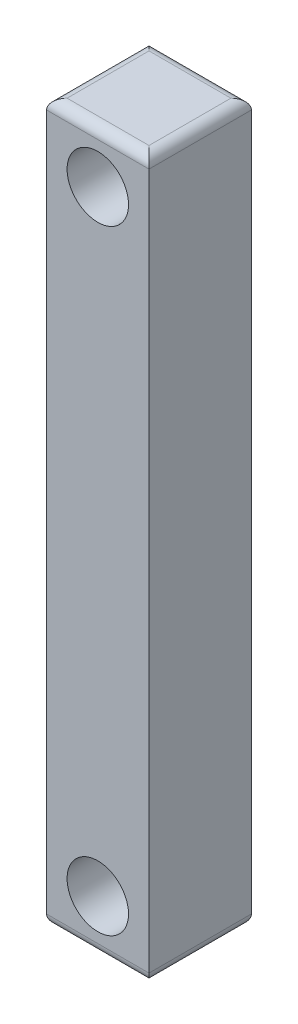
ISO-10303-21;
HEADER;
FILE_DESCRIPTION(('STEP AP214'),'2;1');
FILE_NAME('part.step','',(''),(''),'','','');
FILE_SCHEMA(('AUTOMOTIVE_DESIGN { 1 0 10303 214 1 1 1 1 }'));
ENDSEC;
DATA;
#1=APPLICATION_CONTEXT('core data for automotive mechanical design processes');
#2=APPLICATION_PROTOCOL_DEFINITION('international standard','automotive_design',2000,#1);
#3=PRODUCT_CONTEXT('',#1,'mechanical');
#4=PRODUCT('Part','Part','',(#3));
#5=PRODUCT_RELATED_PRODUCT_CATEGORY('part','',(#4));
#6=PRODUCT_DEFINITION_FORMATION('','',#4);
#7=PRODUCT_DEFINITION_CONTEXT('part definition',#1,'design');
#8=PRODUCT_DEFINITION('design','',#6,#7);
#9=PRODUCT_DEFINITION_SHAPE('','',#8);
#10=(LENGTH_UNIT() NAMED_UNIT(*) SI_UNIT(.MILLI.,.METRE.));
#11=(NAMED_UNIT(*) PLANE_ANGLE_UNIT() SI_UNIT($,.RADIAN.));
#12=(NAMED_UNIT(*) SI_UNIT($,.STERADIAN.) SOLID_ANGLE_UNIT());
#13=UNCERTAINTY_MEASURE_WITH_UNIT(LENGTH_MEASURE(1.E-05),#10,'distance_accuracy_value','');
#14=(GEOMETRIC_REPRESENTATION_CONTEXT(3) GLOBAL_UNCERTAINTY_ASSIGNED_CONTEXT((#13)) GLOBAL_UNIT_ASSIGNED_CONTEXT((#10,
#11,#12)) REPRESENTATION_CONTEXT('',''));
#15=CARTESIAN_POINT('',(0.,0.,0.));
#16=DIRECTION('',(0.,0.,1.));
#17=DIRECTION('',(1.,0.,0.));
#18=AXIS2_PLACEMENT_3D('',#15,#16,#17);
#19=CARTESIAN_POINT('',(-20.5496626180837,69.7557354925776,25.4));
#20=DIRECTION('',(1.,0.,0.));
#21=DIRECTION('',(0.,0.,-1.));
#22=AXIS2_PLACEMENT_3D('',#19,#20,#21);
#23=PLANE('',#22);
#24=DIRECTION('',(0.,-1.,0.));
#25=VECTOR('',#24,1.);
#26=CARTESIAN_POINT('',(-20.5496626180837,69.7557354925776,25.4));
#27=LINE('',#26,#25);
#28=CARTESIAN_POINT('',(-20.5496626180837,67.2157354925776,25.4));
#29=VERTEX_POINT('',#28);
#30=CARTESIAN_POINT('',(-20.5496626180837,-105.504264507422,25.4));
#31=VERTEX_POINT('',#30);
#32=EDGE_CURVE('E184',#29,#31,#27,.T.);
#33=ORIENTED_EDGE('',*,*,#32,.F.);
#34=DIRECTION('',(0.,0.,-1.));
#35=VECTOR('',#34,1.);
#36=CARTESIAN_POINT('',(-20.5496626180837,67.2157354925776,25.4));
#37=LINE('',#36,#35);
#38=CARTESIAN_POINT('',(-20.5496626180837,67.2157354925776,0.));
#39=VERTEX_POINT('',#38);
#40=EDGE_CURVE('E138',#29,#39,#37,.T.);
#41=ORIENTED_EDGE('',*,*,#40,.T.);
#42=DIRECTION('',(0.,-1.,0.));
#43=VECTOR('',#42,1.);
#44=CARTESIAN_POINT('',(-20.5496626180837,69.7557354925776,0.));
#45=LINE('',#44,#43);
#46=CARTESIAN_POINT('',(-20.5496626180837,-105.504264507422,0.));
#47=VERTEX_POINT('',#46);
#48=EDGE_CURVE('E178',#39,#47,#45,.T.);
#49=ORIENTED_EDGE('',*,*,#48,.T.);
#50=DIRECTION('',(0.,0.,-1.));
#51=VECTOR('',#50,1.);
#52=CARTESIAN_POINT('',(-20.5496626180837,-105.504264507422,25.4));
#53=LINE('',#52,#51);
#54=EDGE_CURVE('E135',#47,#31,#53,.F.);
#55=ORIENTED_EDGE('',*,*,#54,.T.);
#56=EDGE_LOOP('',(#33,#41,#49,#55));
#57=FACE_BOUND('',#56,.T.);
#58=ADVANCED_FACE('F35',(#57),#23,.F.);
#59=CARTESIAN_POINT('',(-20.5496626180837,-108.044264507422,25.4));
#60=DIRECTION('',(0.,1.,0.));
#61=DIRECTION('',(0.,0.,1.));
#62=AXIS2_PLACEMENT_3D('',#59,#60,#61);
#63=PLANE('',#62);
#64=DIRECTION('',(1.,0.,0.));
#65=VECTOR('',#64,1.);
#66=CARTESIAN_POINT('',(-20.5496626180837,-108.044264507422,22.86));
#67=LINE('',#66,#65);
#68=CARTESIAN_POINT('',(2.31033738191634,-108.044264507422,22.86));
#69=VERTEX_POINT('',#68);
#70=CARTESIAN_POINT('',(-18.0096626180837,-108.044264507422,22.86));
#71=VERTEX_POINT('',#70);
#72=EDGE_CURVE('E42',#69,#71,#67,.F.);
#73=ORIENTED_EDGE('',*,*,#72,.T.);
#74=DIRECTION('',(0.,0.,-1.));
#75=VECTOR('',#74,1.);
#76=CARTESIAN_POINT('',(-18.0096626180837,-108.044264507422,25.4));
#77=LINE('',#76,#75);
#78=CARTESIAN_POINT('',(-18.0096626180837,-108.044264507422,2.54));
#79=VERTEX_POINT('',#78);
#80=EDGE_CURVE('E11',#71,#79,#77,.T.);
#81=ORIENTED_EDGE('',*,*,#80,.T.);
#82=DIRECTION('',(1.,0.,0.));
#83=VECTOR('',#82,1.);
#84=CARTESIAN_POINT('',(-20.5496626180837,-108.044264507422,2.54));
#85=LINE('',#84,#83);
#86=CARTESIAN_POINT('',(2.31033738191634,-108.044264507422,2.54));
#87=VERTEX_POINT('',#86);
#88=EDGE_CURVE('E144',#79,#87,#85,.T.);
#89=ORIENTED_EDGE('',*,*,#88,.T.);
#90=DIRECTION('',(0.,0.,-1.));
#91=VECTOR('',#90,1.);
#92=CARTESIAN_POINT('',(2.31033738191634,-108.044264507422,25.4));
#93=LINE('',#92,#91);
#94=EDGE_CURVE('E52',#87,#69,#93,.F.);
#95=ORIENTED_EDGE('',*,*,#94,.T.);
#96=EDGE_LOOP('',(#73,#81,#89,#95));
#97=FACE_BOUND('',#96,.T.);
#98=ADVANCED_FACE('F147',(#97),#63,.F.);
#99=CARTESIAN_POINT('',(4.85033738191631,69.7557354925776,25.4));
#100=DIRECTION('',(-1.,0.,0.));
#101=DIRECTION('',(0.,-1.,0.));
#102=AXIS2_PLACEMENT_3D('',#99,#100,#101);
#103=PLANE('',#102);
#104=DIRECTION('',(0.,1.,0.));
#105=VECTOR('',#104,1.);
#106=CARTESIAN_POINT('',(4.85033738191631,69.7557354925776,0.));
#107=LINE('',#106,#105);
#108=CARTESIAN_POINT('',(4.85033738191633,-105.504264507422,0.));
#109=VERTEX_POINT('',#108);
#110=CARTESIAN_POINT('',(4.85033738191631,67.2157354925776,0.));
#111=VERTEX_POINT('',#110);
#112=EDGE_CURVE('E181',#109,#111,#107,.T.);
#113=ORIENTED_EDGE('',*,*,#112,.T.);
#114=DIRECTION('',(0.,0.,-1.));
#115=VECTOR('',#114,1.);
#116=CARTESIAN_POINT('',(4.85033738191631,67.2157354925776,25.4));
#117=LINE('',#116,#115);
#118=CARTESIAN_POINT('',(4.85033738191631,67.2157354925776,25.4));
#119=VERTEX_POINT('',#118);
#120=EDGE_CURVE('E104',#111,#119,#117,.F.);
#121=ORIENTED_EDGE('',*,*,#120,.T.);
#122=DIRECTION('',(0.,1.,0.));
#123=VECTOR('',#122,1.);
#124=CARTESIAN_POINT('',(4.85033738191631,69.7557354925776,25.4));
#125=LINE('',#124,#123);
#126=CARTESIAN_POINT('',(4.85033738191633,-105.504264507422,25.4));
#127=VERTEX_POINT('',#126);
#128=EDGE_CURVE('E187',#127,#119,#125,.T.);
#129=ORIENTED_EDGE('',*,*,#128,.F.);
#130=DIRECTION('',(0.,0.,-1.));
#131=VECTOR('',#130,1.);
#132=CARTESIAN_POINT('',(4.85033738191633,-105.504264507422,25.4));
#133=LINE('',#132,#131);
#134=EDGE_CURVE('E124',#127,#109,#133,.T.);
#135=ORIENTED_EDGE('',*,*,#134,.T.);
#136=EDGE_LOOP('',(#113,#121,#129,#135));
#137=FACE_BOUND('',#136,.T.);
#138=ADVANCED_FACE('F205',(#137),#103,.F.);
#139=CARTESIAN_POINT('',(-20.5496626180837,69.7557354925776,25.4));
#140=DIRECTION('',(0.,-1.,0.));
#141=DIRECTION('',(0.,0.,-1.));
#142=AXIS2_PLACEMENT_3D('',#139,#140,#141);
#143=PLANE('',#142);
#144=DIRECTION('',(-1.,0.,0.));
#145=VECTOR('',#144,1.);
#146=CARTESIAN_POINT('',(4.85033738191631,69.7557354925776,22.86));
#147=LINE('',#146,#145);
#148=CARTESIAN_POINT('',(-18.0096626180837,69.7557354925776,22.86));
#149=VERTEX_POINT('',#148);
#150=CARTESIAN_POINT('',(2.31033738191632,69.7557354925776,22.86));
#151=VERTEX_POINT('',#150);
#152=EDGE_CURVE('E122',#149,#151,#147,.F.);
#153=ORIENTED_EDGE('',*,*,#152,.T.);
#154=DIRECTION('',(0.,0.,-1.));
#155=VECTOR('',#154,1.);
#156=CARTESIAN_POINT('',(2.31033738191632,69.7557354925776,25.4));
#157=LINE('',#156,#155);
#158=CARTESIAN_POINT('',(2.31033738191632,69.7557354925776,2.54));
#159=VERTEX_POINT('',#158);
#160=EDGE_CURVE('E102',#151,#159,#157,.T.);
#161=ORIENTED_EDGE('',*,*,#160,.T.);
#162=DIRECTION('',(-1.,0.,0.));
#163=VECTOR('',#162,1.);
#164=CARTESIAN_POINT('',(-20.5496626180837,69.7557354925776,2.54));
#165=LINE('',#164,#163);
#166=CARTESIAN_POINT('',(-18.0096626180837,69.7557354925776,2.54));
#167=VERTEX_POINT('',#166);
#168=EDGE_CURVE('E111',#159,#167,#165,.T.);
#169=ORIENTED_EDGE('',*,*,#168,.T.);
#170=DIRECTION('',(0.,0.,-1.));
#171=VECTOR('',#170,1.);
#172=CARTESIAN_POINT('',(-18.0096626180837,69.7557354925776,25.4));
#173=LINE('',#172,#171);
#174=EDGE_CURVE('E117',#167,#149,#173,.F.);
#175=ORIENTED_EDGE('',*,*,#174,.T.);
#176=EDGE_LOOP('',(#153,#161,#169,#175));
#177=FACE_BOUND('',#176,.T.);
#178=ADVANCED_FACE('F120',(#177),#143,.F.);
#179=CARTESIAN_POINT('',(-20.5496626180837,-108.044264507422,25.4));
#180=DIRECTION('',(0.,0.,1.));
#181=DIRECTION('',(1.,0.,0.));
#182=AXIS2_PLACEMENT_3D('',#179,#180,#181);
#183=PLANE('',#182);
#184=CARTESIAN_POINT('',(-7.84966261808366,57.0557354925776,25.4));
#185=DIRECTION('',(0.,0.,1.));
#186=DIRECTION('',(1.,0.,0.));
#187=AXIS2_PLACEMENT_3D('',#184,#185,#186);
#188=CIRCLE('',#187,7.62);
#189=CARTESIAN_POINT('',(-0.229662618083664,57.0557354925776,25.4));
#190=VERTEX_POINT('',#189);
#191=EDGE_CURVE('E172',#190,#190,#188,.T.);
#192=ORIENTED_EDGE('',*,*,#191,.F.);
#193=EDGE_LOOP('',(#192));
#194=FACE_BOUND('',#193,.T.);
#195=CARTESIAN_POINT('',(-7.84966261808365,-95.3442645074224,25.4));
#196=DIRECTION('',(0.,0.,1.));
#197=DIRECTION('',(1.,0.,0.));
#198=AXIS2_PLACEMENT_3D('',#195,#196,#197);
#199=CIRCLE('',#198,7.62);
#200=CARTESIAN_POINT('',(-0.229662618083647,-95.3442645074224,25.4));
#201=VERTEX_POINT('',#200);
#202=EDGE_CURVE('E175',#201,#201,#199,.T.);
#203=ORIENTED_EDGE('',*,*,#202,.F.);
#204=EDGE_LOOP('',(#203));
#205=FACE_BOUND('',#204,.T.);
#206=ORIENTED_EDGE('',*,*,#128,.T.);
#207=DIRECTION('',(-1.,0.,0.));
#208=VECTOR('',#207,1.);
#209=CARTESIAN_POINT('',(-20.5496626180837,67.2157354925776,25.4));
#210=LINE('',#209,#208);
#211=EDGE_CURVE('E133',#119,#29,#210,.T.);
#212=ORIENTED_EDGE('',*,*,#211,.T.);
#213=ORIENTED_EDGE('',*,*,#32,.T.);
#214=DIRECTION('',(1.,0.,0.));
#215=VECTOR('',#214,1.);
#216=CARTESIAN_POINT('',(4.85033738191633,-105.504264507422,25.4));
#217=LINE('',#216,#215);
#218=EDGE_CURVE('E131',#31,#127,#217,.T.);
#219=ORIENTED_EDGE('',*,*,#218,.T.);
#220=EDGE_LOOP('',(#206,#212,#213,#219));
#221=FACE_BOUND('',#220,.T.);
#222=ADVANCED_FACE('F207',(#194,#205,#221),#183,.T.);
#223=CARTESIAN_POINT('',(-20.5496626180837,-108.044264507422,0.));
#224=DIRECTION('',(0.,0.,1.));
#225=DIRECTION('',(1.,0.,0.));
#226=AXIS2_PLACEMENT_3D('',#223,#224,#225);
#227=PLANE('',#226);
#228=CARTESIAN_POINT('',(-7.84966261808366,57.0557354925776,0.));
#229=DIRECTION('',(0.,0.,1.));
#230=DIRECTION('',(1.,0.,0.));
#231=AXIS2_PLACEMENT_3D('',#228,#229,#230);
#232=CIRCLE('',#231,7.62);
#233=CARTESIAN_POINT('',(-0.229662618083664,57.0557354925776,0.));
#234=VERTEX_POINT('',#233);
#235=EDGE_CURVE('E118',#234,#234,#232,.T.);
#236=ORIENTED_EDGE('',*,*,#235,.T.);
#237=EDGE_LOOP('',(#236));
#238=FACE_BOUND('',#237,.T.);
#239=CARTESIAN_POINT('',(-7.84966261808365,-95.3442645074224,0.));
#240=DIRECTION('',(0.,0.,1.));
#241=DIRECTION('',(1.,0.,0.));
#242=AXIS2_PLACEMENT_3D('',#239,#240,#241);
#243=CIRCLE('',#242,7.62);
#244=CARTESIAN_POINT('',(-0.229662618083647,-95.3442645074224,0.));
#245=VERTEX_POINT('',#244);
#246=EDGE_CURVE('E190',#245,#245,#243,.T.);
#247=ORIENTED_EDGE('',*,*,#246,.T.);
#248=EDGE_LOOP('',(#247));
#249=FACE_BOUND('',#248,.T.);
#250=ORIENTED_EDGE('',*,*,#48,.F.);
#251=DIRECTION('',(-1.,0.,0.));
#252=VECTOR('',#251,1.);
#253=CARTESIAN_POINT('',(-20.5496626180837,67.2157354925776,0.));
#254=LINE('',#253,#252);
#255=EDGE_CURVE('E142',#39,#111,#254,.F.);
#256=ORIENTED_EDGE('',*,*,#255,.T.);
#257=ORIENTED_EDGE('',*,*,#112,.F.);
#258=DIRECTION('',(1.,0.,0.));
#259=VECTOR('',#258,1.);
#260=CARTESIAN_POINT('',(-20.5496626180837,-105.504264507422,0.));
#261=LINE('',#260,#259);
#262=EDGE_CURVE('E140',#109,#47,#261,.F.);
#263=ORIENTED_EDGE('',*,*,#262,.T.);
#264=EDGE_LOOP('',(#250,#256,#257,#263));
#265=FACE_BOUND('',#264,.T.);
#266=ADVANCED_FACE('F235',(#238,#249,#265),#227,.F.);
#267=CARTESIAN_POINT('',(-7.84966261808365,-95.3442645074224,-53.34));
#268=DIRECTION('',(0.,0.,1.));
#269=DIRECTION('',(1.,0.,0.));
#270=AXIS2_PLACEMENT_3D('',#267,#268,#269);
#271=CYLINDRICAL_SURFACE('',#270,7.62);
#272=ORIENTED_EDGE('',*,*,#202,.T.);
#273=EDGE_LOOP('',(#272));
#274=FACE_BOUND('',#273,.T.);
#275=ORIENTED_EDGE('',*,*,#246,.F.);
#276=EDGE_LOOP('',(#275));
#277=FACE_BOUND('',#276,.T.);
#278=ADVANCED_FACE('F239',(#274,#277),#271,.F.);
#279=CARTESIAN_POINT('',(-7.84966261808366,57.0557354925776,-53.34));
#280=DIRECTION('',(0.,0.,1.));
#281=DIRECTION('',(1.,0.,0.));
#282=AXIS2_PLACEMENT_3D('',#279,#280,#281);
#283=CYLINDRICAL_SURFACE('',#282,7.62);
#284=ORIENTED_EDGE('',*,*,#191,.T.);
#285=EDGE_LOOP('',(#284));
#286=FACE_BOUND('',#285,.T.);
#287=ORIENTED_EDGE('',*,*,#235,.F.);
#288=EDGE_LOOP('',(#287));
#289=FACE_BOUND('',#288,.T.);
#290=ADVANCED_FACE('F243',(#286,#289),#283,.F.);
#291=CARTESIAN_POINT('',(-18.0096626180837,67.2157354925776,25.4));
#292=DIRECTION('',(0.,0.,-1.));
#293=DIRECTION('',(-1.,0.,0.));
#294=AXIS2_PLACEMENT_3D('',#291,#292,#293);
#295=CYLINDRICAL_SURFACE('',#294,2.54);
#296=CARTESIAN_POINT('',(-18.0096626180837,67.2157354925776,2.54));
#297=DIRECTION('',(-0.707106781186548,0.,0.707106781186548));
#298=DIRECTION('',(-0.707106781186548,0.,-0.707106781186548));
#299=AXIS2_PLACEMENT_3D('',#296,#297,#298);
#300=ELLIPSE('',#299,3.59210244842766,2.54);
#301=EDGE_CURVE('E114',#39,#167,#300,.F.);
#302=ORIENTED_EDGE('',*,*,#301,.F.);
#303=ORIENTED_EDGE('',*,*,#40,.F.);
#304=CARTESIAN_POINT('',(-18.0096626180837,67.2157354925776,22.86));
#305=DIRECTION('',(-0.707106781186548,0.,-0.707106781186548));
#306=DIRECTION('',(0.707106781186548,0.,-0.707106781186548));
#307=AXIS2_PLACEMENT_3D('',#304,#305,#306);
#308=ELLIPSE('',#307,3.59210244842766,2.54);
#309=EDGE_CURVE('E169',#149,#29,#308,.F.);
#310=ORIENTED_EDGE('',*,*,#309,.F.);
#311=ORIENTED_EDGE('',*,*,#174,.F.);
#312=EDGE_LOOP('',(#302,#303,#310,#311));
#313=FACE_BOUND('',#312,.T.);
#314=ADVANCED_FACE('F197',(#313),#295,.T.);
#315=CARTESIAN_POINT('',(-20.5496626180837,67.2157354925776,22.86));
#316=DIRECTION('',(1.,0.,0.));
#317=DIRECTION('',(0.,0.,-1.));
#318=AXIS2_PLACEMENT_3D('',#315,#316,#317);
#319=CYLINDRICAL_SURFACE('',#318,2.54);
#320=ORIENTED_EDGE('',*,*,#309,.T.);
#321=ORIENTED_EDGE('',*,*,#211,.F.);
#322=CARTESIAN_POINT('',(2.31033738191631,67.2157354925776,22.86));
#323=DIRECTION('',(0.707106781186548,0.,-0.707106781186548));
#324=DIRECTION('',(0.707106781186548,0.,0.707106781186548));
#325=AXIS2_PLACEMENT_3D('',#322,#323,#324);
#326=ELLIPSE('',#325,3.59210244842766,2.54);
#327=EDGE_CURVE('E107',#151,#119,#326,.T.);
#328=ORIENTED_EDGE('',*,*,#327,.F.);
#329=ORIENTED_EDGE('',*,*,#152,.F.);
#330=EDGE_LOOP('',(#320,#321,#328,#329));
#331=FACE_BOUND('',#330,.T.);
#332=ADVANCED_FACE('F200',(#331),#319,.T.);
#333=CARTESIAN_POINT('',(-20.5496626180837,67.2157354925776,2.54));
#334=DIRECTION('',(-1.,0.,0.));
#335=DIRECTION('',(0.,0.,1.));
#336=AXIS2_PLACEMENT_3D('',#333,#334,#335);
#337=CYLINDRICAL_SURFACE('',#336,2.54);
#338=ORIENTED_EDGE('',*,*,#301,.T.);
#339=ORIENTED_EDGE('',*,*,#168,.F.);
#340=CARTESIAN_POINT('',(2.31033738191631,67.2157354925776,2.54));
#341=DIRECTION('',(-0.707106781186548,0.,-0.707106781186548));
#342=DIRECTION('',(-0.707106781186548,0.,0.707106781186548));
#343=AXIS2_PLACEMENT_3D('',#340,#341,#342);
#344=ELLIPSE('',#343,3.59210244842766,2.54);
#345=EDGE_CURVE('E98',#111,#159,#344,.F.);
#346=ORIENTED_EDGE('',*,*,#345,.F.);
#347=ORIENTED_EDGE('',*,*,#255,.F.);
#348=EDGE_LOOP('',(#338,#339,#346,#347));
#349=FACE_BOUND('',#348,.T.);
#350=ADVANCED_FACE('F112',(#349),#337,.T.);
#351=CARTESIAN_POINT('',(2.31033738191632,67.2157354925776,25.4));
#352=DIRECTION('',(0.,0.,-1.));
#353=DIRECTION('',(-1.,0.,0.));
#354=AXIS2_PLACEMENT_3D('',#351,#352,#353);
#355=CYLINDRICAL_SURFACE('',#354,2.54);
#356=ORIENTED_EDGE('',*,*,#327,.T.);
#357=ORIENTED_EDGE('',*,*,#120,.F.);
#358=ORIENTED_EDGE('',*,*,#345,.T.);
#359=ORIENTED_EDGE('',*,*,#160,.F.);
#360=EDGE_LOOP('',(#356,#357,#358,#359));
#361=FACE_BOUND('',#360,.T.);
#362=ADVANCED_FACE('F100',(#361),#355,.T.);
#363=CARTESIAN_POINT('',(2.31033738191634,-105.504264507422,25.4));
#364=DIRECTION('',(0.,0.,-1.));
#365=DIRECTION('',(-1.,0.,0.));
#366=AXIS2_PLACEMENT_3D('',#363,#364,#365);
#367=CYLINDRICAL_SURFACE('',#366,2.54);
#368=CARTESIAN_POINT('',(2.31033738191633,-105.504264507422,2.54));
#369=DIRECTION('',(0.707106781186548,0.,0.707106781186548));
#370=DIRECTION('',(0.707106781186548,0.,-0.707106781186548));
#371=AXIS2_PLACEMENT_3D('',#368,#369,#370);
#372=ELLIPSE('',#371,3.59210244842766,2.54);
#373=EDGE_CURVE('E156',#109,#87,#372,.F.);
#374=ORIENTED_EDGE('',*,*,#373,.F.);
#375=ORIENTED_EDGE('',*,*,#134,.F.);
#376=CARTESIAN_POINT('',(2.31033738191633,-105.504264507422,22.86));
#377=DIRECTION('',(0.707106781186548,0.,-0.707106781186548));
#378=DIRECTION('',(-0.707106781186548,0.,-0.707106781186548));
#379=AXIS2_PLACEMENT_3D('',#376,#377,#378);
#380=ELLIPSE('',#379,3.59210244842766,2.54);
#381=EDGE_CURVE('E108',#69,#127,#380,.F.);
#382=ORIENTED_EDGE('',*,*,#381,.F.);
#383=ORIENTED_EDGE('',*,*,#94,.F.);
#384=EDGE_LOOP('',(#374,#375,#382,#383));
#385=FACE_BOUND('',#384,.T.);
#386=ADVANCED_FACE('F154',(#385),#367,.T.);
#387=CARTESIAN_POINT('',(-20.5496626180837,-105.504264507422,22.86));
#388=DIRECTION('',(-1.,0.,0.));
#389=DIRECTION('',(0.,0.,1.));
#390=AXIS2_PLACEMENT_3D('',#387,#388,#389);
#391=CYLINDRICAL_SURFACE('',#390,2.54);
#392=ORIENTED_EDGE('',*,*,#381,.T.);
#393=ORIENTED_EDGE('',*,*,#218,.F.);
#394=CARTESIAN_POINT('',(-18.0096626180837,-105.504264507422,22.86));
#395=DIRECTION('',(-0.707106781186548,0.,-0.707106781186548));
#396=DIRECTION('',(-0.707106781186548,0.,0.707106781186548));
#397=AXIS2_PLACEMENT_3D('',#394,#395,#396);
#398=ELLIPSE('',#397,3.59210244842766,2.54);
#399=EDGE_CURVE('E160',#71,#31,#398,.T.);
#400=ORIENTED_EDGE('',*,*,#399,.F.);
#401=ORIENTED_EDGE('',*,*,#72,.F.);
#402=EDGE_LOOP('',(#392,#393,#400,#401));
#403=FACE_BOUND('',#402,.T.);
#404=ADVANCED_FACE('F210',(#403),#391,.T.);
#405=CARTESIAN_POINT('',(-20.5496626180837,-105.504264507422,2.54));
#406=DIRECTION('',(1.,0.,0.));
#407=DIRECTION('',(0.,0.,-1.));
#408=AXIS2_PLACEMENT_3D('',#405,#406,#407);
#409=CYLINDRICAL_SURFACE('',#408,2.54);
#410=ORIENTED_EDGE('',*,*,#373,.T.);
#411=ORIENTED_EDGE('',*,*,#88,.F.);
#412=CARTESIAN_POINT('',(-18.0096626180837,-105.504264507422,2.54));
#413=DIRECTION('',(0.707106781186548,0.,-0.707106781186548));
#414=DIRECTION('',(0.707106781186548,0.,0.707106781186548));
#415=AXIS2_PLACEMENT_3D('',#412,#413,#414);
#416=ELLIPSE('',#415,3.59210244842766,2.54);
#417=EDGE_CURVE('E163',#47,#79,#416,.F.);
#418=ORIENTED_EDGE('',*,*,#417,.F.);
#419=ORIENTED_EDGE('',*,*,#262,.F.);
#420=EDGE_LOOP('',(#410,#411,#418,#419));
#421=FACE_BOUND('',#420,.T.);
#422=ADVANCED_FACE('F159',(#421),#409,.T.);
#423=CARTESIAN_POINT('',(-18.0096626180837,-105.504264507422,25.4));
#424=DIRECTION('',(0.,0.,-1.));
#425=DIRECTION('',(-1.,0.,0.));
#426=AXIS2_PLACEMENT_3D('',#423,#424,#425);
#427=CYLINDRICAL_SURFACE('',#426,2.54);
#428=ORIENTED_EDGE('',*,*,#399,.T.);
#429=ORIENTED_EDGE('',*,*,#54,.F.);
#430=ORIENTED_EDGE('',*,*,#417,.T.);
#431=ORIENTED_EDGE('',*,*,#80,.F.);
#432=EDGE_LOOP('',(#428,#429,#430,#431));
#433=FACE_BOUND('',#432,.T.);
#434=ADVANCED_FACE('F215',(#433),#427,.T.);
#435=CLOSED_SHELL('',(#58,#98,#138,#178,#222,#266,#278,#290,#314,#332,#350,#362,#386,#404,#422,#434));
#436=MANIFOLD_SOLID_BREP('B2',#435);
#437=ADVANCED_BREP_SHAPE_REPRESENTATION('',(#18,#436),#14);
#438=SHAPE_DEFINITION_REPRESENTATION(#9,#437);
ENDSEC;
END-ISO-10303-21;
